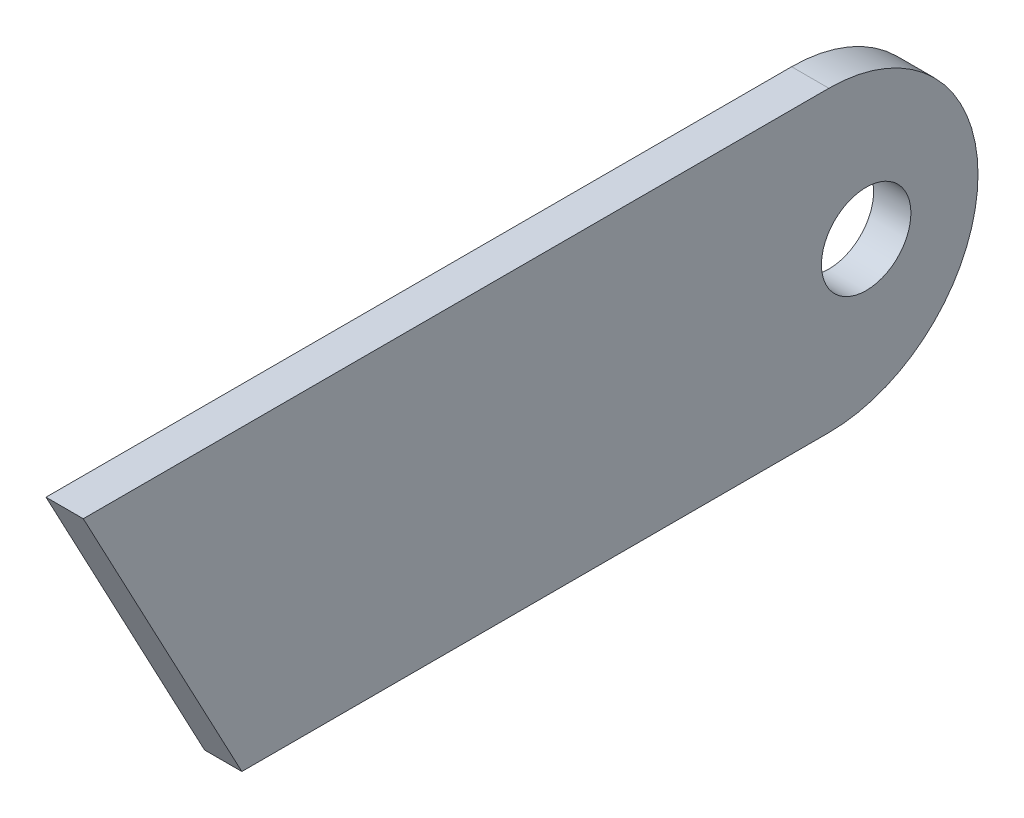
ISO-10303-21;
HEADER;
FILE_DESCRIPTION(('STEP AP214'),'2;1');
FILE_NAME('part.step','',(''),(''),'','','');
FILE_SCHEMA(('AUTOMOTIVE_DESIGN { 1 0 10303 214 1 1 1 1 }'));
ENDSEC;
DATA;
#1=APPLICATION_CONTEXT('core data for automotive mechanical design processes');
#2=APPLICATION_PROTOCOL_DEFINITION('international standard','automotive_design',2000,#1);
#3=PRODUCT_CONTEXT('',#1,'mechanical');
#4=PRODUCT('Part','Part','',(#3));
#5=PRODUCT_RELATED_PRODUCT_CATEGORY('part','',(#4));
#6=PRODUCT_DEFINITION_FORMATION('','',#4);
#7=PRODUCT_DEFINITION_CONTEXT('part definition',#1,'design');
#8=PRODUCT_DEFINITION('design','',#6,#7);
#9=PRODUCT_DEFINITION_SHAPE('','',#8);
#10=(LENGTH_UNIT() NAMED_UNIT(*) SI_UNIT(.MILLI.,.METRE.));
#11=(NAMED_UNIT(*) PLANE_ANGLE_UNIT() SI_UNIT($,.RADIAN.));
#12=(NAMED_UNIT(*) SI_UNIT($,.STERADIAN.) SOLID_ANGLE_UNIT());
#13=UNCERTAINTY_MEASURE_WITH_UNIT(LENGTH_MEASURE(1.E-05),#10,'distance_accuracy_value','');
#14=(GEOMETRIC_REPRESENTATION_CONTEXT(3) GLOBAL_UNCERTAINTY_ASSIGNED_CONTEXT((#13)) GLOBAL_UNIT_ASSIGNED_CONTEXT((#10,
#11,#12)) REPRESENTATION_CONTEXT('',''));
#15=CARTESIAN_POINT('',(0.,0.,0.));
#16=DIRECTION('',(0.,0.,1.));
#17=DIRECTION('',(1.,0.,0.));
#18=AXIS2_PLACEMENT_3D('',#15,#16,#17);
#19=CARTESIAN_POINT('',(154.,-40.,-55.));
#20=DIRECTION('',(0.,1.,0.));
#21=DIRECTION('',(1.,0.,0.));
#22=AXIS2_PLACEMENT_3D('',#19,#20,#21);
#23=PLANE('',#22);
#24=DIRECTION('',(0.,0.,1.));
#25=VECTOR('',#24,1.);
#26=CARTESIAN_POINT('',(154.,-40.,-55.));
#27=LINE('',#26,#25);
#28=CARTESIAN_POINT('',(154.,-40.,-35.));
#29=VERTEX_POINT('',#28);
#30=CARTESIAN_POINT('',(154.,-40.0000000000007,43.7316227335412));
#31=VERTEX_POINT('',#30);
#32=EDGE_CURVE('E112',#29,#31,#27,.T.);
#33=ORIENTED_EDGE('',*,*,#32,.T.);
#34=DIRECTION('',(1.,0.,0.));
#35=VECTOR('',#34,1.);
#36=CARTESIAN_POINT('',(144.,-40.0000000000007,43.7316227335412));
#37=LINE('',#36,#35);
#38=CARTESIAN_POINT('',(149.,-40.0000000000007,43.7316227335412));
#39=VERTEX_POINT('',#38);
#40=EDGE_CURVE('E102',#39,#31,#37,.T.);
#41=ORIENTED_EDGE('',*,*,#40,.F.);
#42=DIRECTION('',(0.,0.,1.));
#43=VECTOR('',#42,1.);
#44=CARTESIAN_POINT('',(149.,-40.,-55.));
#45=LINE('',#44,#43);
#46=CARTESIAN_POINT('',(149.,-40.,-35.));
#47=VERTEX_POINT('',#46);
#48=EDGE_CURVE('E95',#47,#39,#45,.T.);
#49=ORIENTED_EDGE('',*,*,#48,.F.);
#50=DIRECTION('',(1.,0.,0.));
#51=VECTOR('',#50,1.);
#52=CARTESIAN_POINT('',(154.,-40.,-35.));
#53=LINE('',#52,#51);
#54=EDGE_CURVE('E130',#29,#47,#53,.F.);
#55=ORIENTED_EDGE('',*,*,#54,.F.);
#56=EDGE_LOOP('',(#33,#41,#49,#55));
#57=FACE_BOUND('',#56,.T.);
#58=ADVANCED_FACE('F38',(#57),#23,.F.);
#59=CARTESIAN_POINT('',(154.,-40.,-55.));
#60=DIRECTION('',(-1.,0.,0.));
#61=DIRECTION('',(0.,1.,0.));
#62=AXIS2_PLACEMENT_3D('',#59,#60,#61);
#63=PLANE('',#62);
#64=CARTESIAN_POINT('',(154.,-20.,-40.));
#65=DIRECTION('',(-1.,0.,0.));
#66=DIRECTION('',(0.,-1.,0.));
#67=AXIS2_PLACEMENT_3D('',#64,#65,#66);
#68=CIRCLE('',#67,5.99999999999979);
#69=CARTESIAN_POINT('',(154.,-25.9999999999998,-40.));
#70=VERTEX_POINT('',#69);
#71=EDGE_CURVE('E124',#70,#70,#68,.T.);
#72=ORIENTED_EDGE('',*,*,#71,.T.);
#73=EDGE_LOOP('',(#72));
#74=FACE_BOUND('',#73,.T.);
#75=CARTESIAN_POINT('',(154.,-20.,-35.));
#76=DIRECTION('',(1.,0.,0.));
#77=DIRECTION('',(0.,1.,0.));
#78=AXIS2_PLACEMENT_3D('',#75,#76,#77);
#79=CIRCLE('',#78,20.);
#80=CARTESIAN_POINT('',(154.,0.,-35.));
#81=VERTEX_POINT('',#80);
#82=CARTESIAN_POINT('',(154.,-20.,-55.));
#83=VERTEX_POINT('',#82);
#84=EDGE_CURVE('E110',#81,#83,#79,.F.);
#85=ORIENTED_EDGE('',*,*,#84,.F.);
#86=DIRECTION('',(0.,0.,1.));
#87=VECTOR('',#86,1.);
#88=CARTESIAN_POINT('',(154.,0.,-55.));
#89=LINE('',#88,#87);
#90=CARTESIAN_POINT('',(154.,-6.6266436782314E-13,65.));
#91=VERTEX_POINT('',#90);
#92=EDGE_CURVE('E89',#81,#91,#89,.T.);
#93=ORIENTED_EDGE('',*,*,#92,.T.);
#94=DIRECTION('',(0.,-0.88294759285893,-0.469471562785885));
#95=VECTOR('',#94,1.);
#96=CARTESIAN_POINT('',(154.,-6.6266436782314E-13,65.));
#97=LINE('',#96,#95);
#98=EDGE_CURVE('E99',#91,#31,#97,.T.);
#99=ORIENTED_EDGE('',*,*,#98,.T.);
#100=ORIENTED_EDGE('',*,*,#32,.F.);
#101=CARTESIAN_POINT('',(154.,-20.,-35.));
#102=DIRECTION('',(1.,0.,0.));
#103=DIRECTION('',(0.,1.,0.));
#104=AXIS2_PLACEMENT_3D('',#101,#102,#103);
#105=CIRCLE('',#104,20.);
#106=EDGE_CURVE('E127',#83,#29,#105,.F.);
#107=ORIENTED_EDGE('',*,*,#106,.F.);
#108=EDGE_LOOP('',(#85,#93,#99,#100,#107));
#109=FACE_BOUND('',#108,.T.);
#110=ADVANCED_FACE('F108',(#74,#109),#63,.F.);
#111=CARTESIAN_POINT('',(149.,0.,-55.));
#112=DIRECTION('',(0.,-1.,0.));
#113=DIRECTION('',(-1.,0.,0.));
#114=AXIS2_PLACEMENT_3D('',#111,#112,#113);
#115=PLANE('',#114);
#116=DIRECTION('',(0.,0.,1.));
#117=VECTOR('',#116,1.);
#118=CARTESIAN_POINT('',(149.,0.,-55.));
#119=LINE('',#118,#117);
#120=CARTESIAN_POINT('',(149.,0.,-35.));
#121=VERTEX_POINT('',#120);
#122=CARTESIAN_POINT('',(149.,0.,65.));
#123=VERTEX_POINT('',#122);
#124=EDGE_CURVE('E92',#121,#123,#119,.T.);
#125=ORIENTED_EDGE('',*,*,#124,.T.);
#126=DIRECTION('',(-1.,0.,0.));
#127=VECTOR('',#126,1.);
#128=CARTESIAN_POINT('',(149.,0.,65.));
#129=LINE('',#128,#127);
#130=EDGE_CURVE('E85',#91,#123,#129,.T.);
#131=ORIENTED_EDGE('',*,*,#130,.F.);
#132=ORIENTED_EDGE('',*,*,#92,.F.);
#133=DIRECTION('',(-1.,0.,0.));
#134=VECTOR('',#133,1.);
#135=CARTESIAN_POINT('',(149.,0.,-35.));
#136=LINE('',#135,#134);
#137=EDGE_CURVE('E11',#121,#81,#136,.F.);
#138=ORIENTED_EDGE('',*,*,#137,.F.);
#139=EDGE_LOOP('',(#125,#131,#132,#138));
#140=FACE_BOUND('',#139,.T.);
#141=ADVANCED_FACE('F87',(#140),#115,.F.);
#142=CARTESIAN_POINT('',(149.,-40.,-55.));
#143=DIRECTION('',(1.,0.,0.));
#144=DIRECTION('',(0.,-1.,0.));
#145=AXIS2_PLACEMENT_3D('',#142,#143,#144);
#146=PLANE('',#145);
#147=CARTESIAN_POINT('',(149.,-20.,-40.));
#148=DIRECTION('',(-1.,0.,0.));
#149=DIRECTION('',(0.,-1.,0.));
#150=AXIS2_PLACEMENT_3D('',#147,#148,#149);
#151=CIRCLE('',#150,5.99999999999979);
#152=CARTESIAN_POINT('',(149.,-25.9999999999998,-40.));
#153=VERTEX_POINT('',#152);
#154=EDGE_CURVE('E96',#153,#153,#151,.T.);
#155=ORIENTED_EDGE('',*,*,#154,.F.);
#156=EDGE_LOOP('',(#155));
#157=FACE_BOUND('',#156,.T.);
#158=ORIENTED_EDGE('',*,*,#48,.T.);
#159=DIRECTION('',(0.,-0.88294759285893,-0.469471562785885));
#160=VECTOR('',#159,1.);
#161=CARTESIAN_POINT('',(149.,-80.9261124227174,21.970822757145));
#162=LINE('',#161,#160);
#163=EDGE_CURVE('E146',#123,#39,#162,.T.);
#164=ORIENTED_EDGE('',*,*,#163,.F.);
#165=ORIENTED_EDGE('',*,*,#124,.F.);
#166=CARTESIAN_POINT('',(149.,-20.,-35.));
#167=DIRECTION('',(-1.,0.,0.));
#168=DIRECTION('',(0.,-1.,0.));
#169=AXIS2_PLACEMENT_3D('',#166,#167,#168);
#170=CIRCLE('',#169,20.);
#171=CARTESIAN_POINT('',(149.,-20.,-55.));
#172=VERTEX_POINT('',#171);
#173=EDGE_CURVE('E58',#172,#121,#170,.F.);
#174=ORIENTED_EDGE('',*,*,#173,.F.);
#175=CARTESIAN_POINT('',(149.,-20.,-35.));
#176=DIRECTION('',(-1.,0.,0.));
#177=DIRECTION('',(0.,-1.,0.));
#178=AXIS2_PLACEMENT_3D('',#175,#176,#177);
#179=CIRCLE('',#178,20.);
#180=EDGE_CURVE('E48',#47,#172,#179,.F.);
#181=ORIENTED_EDGE('',*,*,#180,.F.);
#182=EDGE_LOOP('',(#158,#164,#165,#174,#181));
#183=FACE_BOUND('',#182,.T.);
#184=ADVANCED_FACE('F145',(#157,#183),#146,.F.);
#185=CARTESIAN_POINT('',(144.,-20.,-40.));
#186=DIRECTION('',(1.,0.,0.));
#187=DIRECTION('',(0.,-1.,0.));
#188=AXIS2_PLACEMENT_3D('',#185,#186,#187);
#189=CYLINDRICAL_SURFACE('',#188,5.99999999999979);
#190=ORIENTED_EDGE('',*,*,#71,.F.);
#191=EDGE_LOOP('',(#190));
#192=FACE_BOUND('',#191,.T.);
#193=ORIENTED_EDGE('',*,*,#154,.T.);
#194=EDGE_LOOP('',(#193));
#195=FACE_BOUND('',#194,.T.);
#196=ADVANCED_FACE('F163',(#192,#195),#189,.F.);
#197=CARTESIAN_POINT('',(144.,-6.90419943438769E-13,65.));
#198=DIRECTION('',(0.,0.469471562785885,-0.88294759285893));
#199=DIRECTION('',(0.,0.88294759285893,0.469471562785885));
#200=AXIS2_PLACEMENT_3D('',#197,#198,#199);
#201=PLANE('',#200);
#202=ORIENTED_EDGE('',*,*,#130,.T.);
#203=ORIENTED_EDGE('',*,*,#163,.T.);
#204=ORIENTED_EDGE('',*,*,#40,.T.);
#205=ORIENTED_EDGE('',*,*,#98,.F.);
#206=EDGE_LOOP('',(#202,#203,#204,#205));
#207=FACE_BOUND('',#206,.T.);
#208=ADVANCED_FACE('F100',(#207),#201,.F.);
#209=CARTESIAN_POINT('',(2.50000000000006,-20.0000000000006,-35.));
#210=DIRECTION('',(-1.,0.,0.));
#211=DIRECTION('',(0.,1.,0.));
#212=AXIS2_PLACEMENT_3D('',#209,#210,#211);
#213=CYLINDRICAL_SURFACE('',#212,20.);
#214=ORIENTED_EDGE('',*,*,#137,.T.);
#215=ORIENTED_EDGE('',*,*,#84,.T.);
#216=DIRECTION('',(-1.,0.,0.));
#217=VECTOR('',#216,1.);
#218=CARTESIAN_POINT('',(2.50000000000006,-20.0000000000006,-55.));
#219=LINE('',#218,#217);
#220=EDGE_CURVE('E42',#83,#172,#219,.T.);
#221=ORIENTED_EDGE('',*,*,#220,.T.);
#222=ORIENTED_EDGE('',*,*,#173,.T.);
#223=EDGE_LOOP('',(#214,#215,#221,#222));
#224=FACE_BOUND('',#223,.T.);
#225=ADVANCED_FACE('F40',(#224),#213,.T.);
#226=CARTESIAN_POINT('',(2.50000000000006,-20.0000000000006,-35.));
#227=DIRECTION('',(1.,0.,0.));
#228=DIRECTION('',(0.,-1.,0.));
#229=AXIS2_PLACEMENT_3D('',#226,#227,#228);
#230=CYLINDRICAL_SURFACE('',#229,20.);
#231=ORIENTED_EDGE('',*,*,#180,.T.);
#232=ORIENTED_EDGE('',*,*,#220,.F.);
#233=ORIENTED_EDGE('',*,*,#106,.T.);
#234=ORIENTED_EDGE('',*,*,#54,.T.);
#235=EDGE_LOOP('',(#231,#232,#233,#234));
#236=FACE_BOUND('',#235,.T.);
#237=ADVANCED_FACE('F140',(#236),#230,.T.);
#238=CLOSED_SHELL('',(#58,#110,#141,#184,#196,#208,#225,#237));
#239=MANIFOLD_SOLID_BREP('B2',#238);
#240=ADVANCED_BREP_SHAPE_REPRESENTATION('',(#18,#239),#14);
#241=SHAPE_DEFINITION_REPRESENTATION(#9,#240);
ENDSEC;
END-ISO-10303-21;
